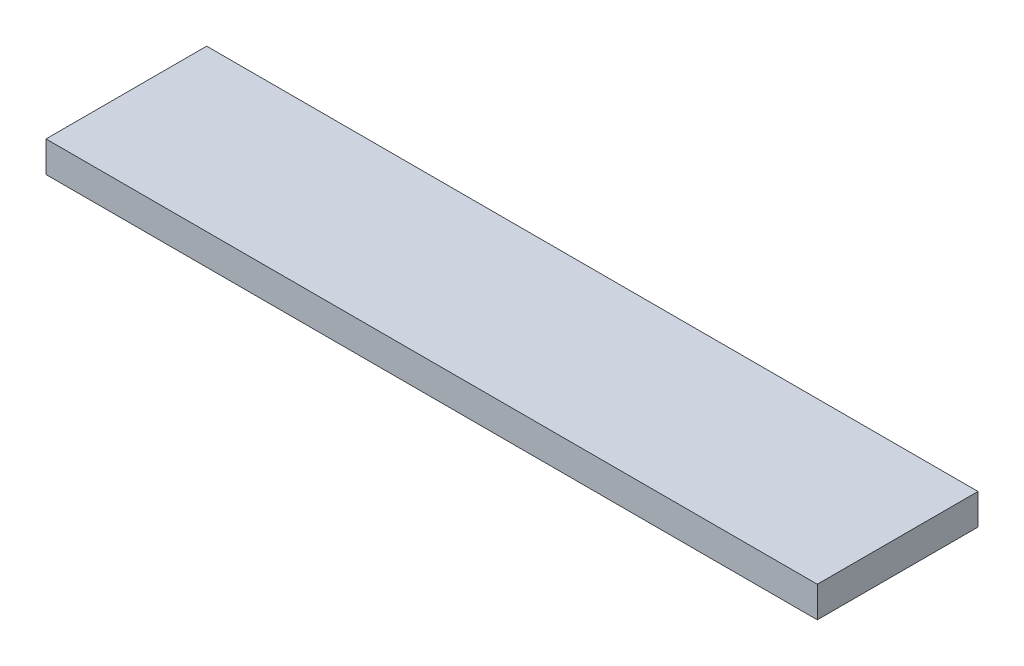
ISO-10303-21;
HEADER;
FILE_DESCRIPTION(('STEP AP214'),'2;1');
FILE_NAME('part.step','',(''),(''),'','','');
FILE_SCHEMA(('AUTOMOTIVE_DESIGN { 1 0 10303 214 1 1 1 1 }'));
ENDSEC;
DATA;
#1=APPLICATION_CONTEXT('core data for automotive mechanical design processes');
#2=APPLICATION_PROTOCOL_DEFINITION('international standard','automotive_design',2000,#1);
#3=PRODUCT_CONTEXT('',#1,'mechanical');
#4=PRODUCT('Part','Part','',(#3));
#5=PRODUCT_RELATED_PRODUCT_CATEGORY('part','',(#4));
#6=PRODUCT_DEFINITION_FORMATION('','',#4);
#7=PRODUCT_DEFINITION_CONTEXT('part definition',#1,'design');
#8=PRODUCT_DEFINITION('design','',#6,#7);
#9=PRODUCT_DEFINITION_SHAPE('','',#8);
#10=(LENGTH_UNIT() NAMED_UNIT(*) SI_UNIT(.MILLI.,.METRE.));
#11=(NAMED_UNIT(*) PLANE_ANGLE_UNIT() SI_UNIT($,.RADIAN.));
#12=(NAMED_UNIT(*) SI_UNIT($,.STERADIAN.) SOLID_ANGLE_UNIT());
#13=UNCERTAINTY_MEASURE_WITH_UNIT(LENGTH_MEASURE(1.E-05),#10,'distance_accuracy_value','');
#14=(GEOMETRIC_REPRESENTATION_CONTEXT(3) GLOBAL_UNCERTAINTY_ASSIGNED_CONTEXT((#13)) GLOBAL_UNIT_ASSIGNED_CONTEXT((#10,
#11,#12)) REPRESENTATION_CONTEXT('',''));
#15=CARTESIAN_POINT('',(0.,0.,0.));
#16=DIRECTION('',(0.,0.,1.));
#17=DIRECTION('',(1.,0.,0.));
#18=AXIS2_PLACEMENT_3D('',#15,#16,#17);
#19=CARTESIAN_POINT('',(150.,12.,-31.25));
#20=DIRECTION('',(-1.,0.,0.));
#21=DIRECTION('',(0.,0.,1.));
#22=AXIS2_PLACEMENT_3D('',#19,#20,#21);
#23=PLANE('',#22);
#24=DIRECTION('',(0.,0.,-1.));
#25=VECTOR('',#24,1.);
#26=CARTESIAN_POINT('',(150.,0.,-31.25));
#27=LINE('',#26,#25);
#28=CARTESIAN_POINT('',(150.,0.,31.25));
#29=VERTEX_POINT('',#28);
#30=CARTESIAN_POINT('',(150.,0.,-31.25));
#31=VERTEX_POINT('',#30);
#32=EDGE_CURVE('E96',#29,#31,#27,.T.);
#33=ORIENTED_EDGE('',*,*,#32,.T.);
#34=DIRECTION('',(0.,-1.,0.));
#35=VECTOR('',#34,1.);
#36=CARTESIAN_POINT('',(150.,12.,-31.25));
#37=LINE('',#36,#35);
#38=CARTESIAN_POINT('',(150.,12.,-31.25));
#39=VERTEX_POINT('',#38);
#40=EDGE_CURVE('E11',#39,#31,#37,.T.);
#41=ORIENTED_EDGE('',*,*,#40,.F.);
#42=DIRECTION('',(0.,0.,-1.));
#43=VECTOR('',#42,1.);
#44=CARTESIAN_POINT('',(150.,12.,-31.25));
#45=LINE('',#44,#43);
#46=CARTESIAN_POINT('',(150.,12.,31.25));
#47=VERTEX_POINT('',#46);
#48=EDGE_CURVE('E84',#47,#39,#45,.T.);
#49=ORIENTED_EDGE('',*,*,#48,.F.);
#50=DIRECTION('',(0.,-1.,0.));
#51=VECTOR('',#50,1.);
#52=CARTESIAN_POINT('',(150.,12.,31.25));
#53=LINE('',#52,#51);
#54=EDGE_CURVE('E92',#47,#29,#53,.T.);
#55=ORIENTED_EDGE('',*,*,#54,.T.);
#56=EDGE_LOOP('',(#33,#41,#49,#55));
#57=FACE_BOUND('',#56,.T.);
#58=ADVANCED_FACE('F33',(#57),#23,.F.);
#59=CARTESIAN_POINT('',(-150.,12.,-31.25));
#60=DIRECTION('',(0.,0.,1.));
#61=DIRECTION('',(1.,0.,0.));
#62=AXIS2_PLACEMENT_3D('',#59,#60,#61);
#63=PLANE('',#62);
#64=DIRECTION('',(-1.,0.,0.));
#65=VECTOR('',#64,1.);
#66=CARTESIAN_POINT('',(-150.,0.,-31.25));
#67=LINE('',#66,#65);
#68=CARTESIAN_POINT('',(-150.,0.,-31.25));
#69=VERTEX_POINT('',#68);
#70=EDGE_CURVE('E88',#31,#69,#67,.T.);
#71=ORIENTED_EDGE('',*,*,#70,.T.);
#72=DIRECTION('',(0.,-1.,0.));
#73=VECTOR('',#72,1.);
#74=CARTESIAN_POINT('',(-150.,12.,-31.25));
#75=LINE('',#74,#73);
#76=CARTESIAN_POINT('',(-150.,12.,-31.25));
#77=VERTEX_POINT('',#76);
#78=EDGE_CURVE('E41',#77,#69,#75,.T.);
#79=ORIENTED_EDGE('',*,*,#78,.F.);
#80=DIRECTION('',(-1.,0.,0.));
#81=VECTOR('',#80,1.);
#82=CARTESIAN_POINT('',(-150.,12.,-31.25));
#83=LINE('',#82,#81);
#84=EDGE_CURVE('E79',#39,#77,#83,.T.);
#85=ORIENTED_EDGE('',*,*,#84,.F.);
#86=ORIENTED_EDGE('',*,*,#40,.T.);
#87=EDGE_LOOP('',(#71,#79,#85,#86));
#88=FACE_BOUND('',#87,.T.);
#89=ADVANCED_FACE('F87',(#88),#63,.F.);
#90=CARTESIAN_POINT('',(-150.,12.,-31.25));
#91=DIRECTION('',(1.,0.,0.));
#92=DIRECTION('',(0.,0.,-1.));
#93=AXIS2_PLACEMENT_3D('',#90,#91,#92);
#94=PLANE('',#93);
#95=DIRECTION('',(0.,0.,1.));
#96=VECTOR('',#95,1.);
#97=CARTESIAN_POINT('',(-150.,0.,-31.25));
#98=LINE('',#97,#96);
#99=CARTESIAN_POINT('',(-150.,0.,31.25));
#100=VERTEX_POINT('',#99);
#101=EDGE_CURVE('E66',#69,#100,#98,.T.);
#102=ORIENTED_EDGE('',*,*,#101,.T.);
#103=DIRECTION('',(0.,-1.,0.));
#104=VECTOR('',#103,1.);
#105=CARTESIAN_POINT('',(-150.,12.,31.25));
#106=LINE('',#105,#104);
#107=CARTESIAN_POINT('',(-150.,12.,31.25));
#108=VERTEX_POINT('',#107);
#109=EDGE_CURVE('E89',#108,#100,#106,.T.);
#110=ORIENTED_EDGE('',*,*,#109,.F.);
#111=DIRECTION('',(0.,0.,1.));
#112=VECTOR('',#111,1.);
#113=CARTESIAN_POINT('',(-150.,12.,-31.25));
#114=LINE('',#113,#112);
#115=EDGE_CURVE('E82',#77,#108,#114,.T.);
#116=ORIENTED_EDGE('',*,*,#115,.F.);
#117=ORIENTED_EDGE('',*,*,#78,.T.);
#118=EDGE_LOOP('',(#102,#110,#116,#117));
#119=FACE_BOUND('',#118,.T.);
#120=ADVANCED_FACE('F90',(#119),#94,.F.);
#121=CARTESIAN_POINT('',(-150.,12.,31.25));
#122=DIRECTION('',(0.,0.,-1.));
#123=DIRECTION('',(-1.,0.,0.));
#124=AXIS2_PLACEMENT_3D('',#121,#122,#123);
#125=PLANE('',#124);
#126=DIRECTION('',(1.,0.,0.));
#127=VECTOR('',#126,1.);
#128=CARTESIAN_POINT('',(-150.,0.,31.25));
#129=LINE('',#128,#127);
#130=EDGE_CURVE('E72',#100,#29,#129,.T.);
#131=ORIENTED_EDGE('',*,*,#130,.T.);
#132=ORIENTED_EDGE('',*,*,#54,.F.);
#133=DIRECTION('',(1.,0.,0.));
#134=VECTOR('',#133,1.);
#135=CARTESIAN_POINT('',(-150.,12.,31.25));
#136=LINE('',#135,#134);
#137=EDGE_CURVE('E49',#108,#47,#136,.T.);
#138=ORIENTED_EDGE('',*,*,#137,.F.);
#139=ORIENTED_EDGE('',*,*,#109,.T.);
#140=EDGE_LOOP('',(#131,#132,#138,#139));
#141=FACE_BOUND('',#140,.T.);
#142=ADVANCED_FACE('F103',(#141),#125,.F.);
#143=CARTESIAN_POINT('',(0.,12.,0.));
#144=DIRECTION('',(0.,1.,0.));
#145=DIRECTION('',(0.,0.,1.));
#146=AXIS2_PLACEMENT_3D('',#143,#144,#145);
#147=PLANE('',#146);
#148=ORIENTED_EDGE('',*,*,#48,.T.);
#149=ORIENTED_EDGE('',*,*,#84,.T.);
#150=ORIENTED_EDGE('',*,*,#115,.T.);
#151=ORIENTED_EDGE('',*,*,#137,.T.);
#152=EDGE_LOOP('',(#148,#149,#150,#151));
#153=FACE_BOUND('',#152,.T.);
#154=ADVANCED_FACE('F80',(#153),#147,.T.);
#155=CARTESIAN_POINT('',(0.,0.,0.));
#156=DIRECTION('',(0.,1.,0.));
#157=DIRECTION('',(0.,0.,1.));
#158=AXIS2_PLACEMENT_3D('',#155,#156,#157);
#159=PLANE('',#158);
#160=ORIENTED_EDGE('',*,*,#32,.F.);
#161=ORIENTED_EDGE('',*,*,#130,.F.);
#162=ORIENTED_EDGE('',*,*,#101,.F.);
#163=ORIENTED_EDGE('',*,*,#70,.F.);
#164=EDGE_LOOP('',(#160,#161,#162,#163));
#165=FACE_BOUND('',#164,.T.);
#166=ADVANCED_FACE('F106',(#165),#159,.F.);
#167=CLOSED_SHELL('',(#58,#89,#120,#142,#154,#166));
#168=MANIFOLD_SOLID_BREP('B2',#167);
#169=ADVANCED_BREP_SHAPE_REPRESENTATION('',(#18,#168),#14);
#170=SHAPE_DEFINITION_REPRESENTATION(#9,#169);
ENDSEC;
END-ISO-10303-21;
